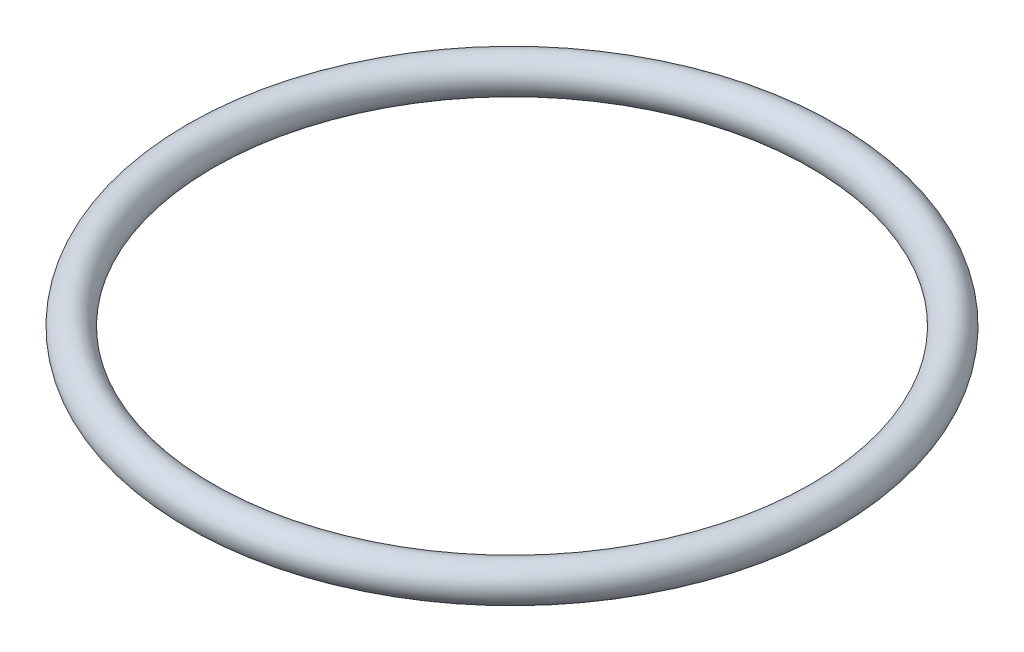
ISO-10303-21;
HEADER;
FILE_DESCRIPTION(('STEP AP214'),'2;1');
FILE_NAME('part.step','',(''),(''),'','','');
FILE_SCHEMA(('AUTOMOTIVE_DESIGN { 1 0 10303 214 1 1 1 1 }'));
ENDSEC;
DATA;
#1=APPLICATION_CONTEXT('core data for automotive mechanical design processes');
#2=APPLICATION_PROTOCOL_DEFINITION('international standard','automotive_design',2000,#1);
#3=PRODUCT_CONTEXT('',#1,'mechanical');
#4=PRODUCT('Part','Part','',(#3));
#5=PRODUCT_RELATED_PRODUCT_CATEGORY('part','',(#4));
#6=PRODUCT_DEFINITION_FORMATION('','',#4);
#7=PRODUCT_DEFINITION_CONTEXT('part definition',#1,'design');
#8=PRODUCT_DEFINITION('design','',#6,#7);
#9=PRODUCT_DEFINITION_SHAPE('','',#8);
#10=(LENGTH_UNIT() NAMED_UNIT(*) SI_UNIT(.MILLI.,.METRE.));
#11=(NAMED_UNIT(*) PLANE_ANGLE_UNIT() SI_UNIT($,.RADIAN.));
#12=(NAMED_UNIT(*) SI_UNIT($,.STERADIAN.) SOLID_ANGLE_UNIT());
#13=UNCERTAINTY_MEASURE_WITH_UNIT(LENGTH_MEASURE(1.E-05),#10,'distance_accuracy_value','');
#14=(GEOMETRIC_REPRESENTATION_CONTEXT(3) GLOBAL_UNCERTAINTY_ASSIGNED_CONTEXT((#13)) GLOBAL_UNIT_ASSIGNED_CONTEXT((#10,
#11,#12)) REPRESENTATION_CONTEXT('',''));
#15=CARTESIAN_POINT('',(0.,0.,0.));
#16=DIRECTION('',(0.,0.,1.));
#17=DIRECTION('',(1.,0.,0.));
#18=AXIS2_PLACEMENT_3D('',#15,#16,#17);
#19=CARTESIAN_POINT('',(46.5455,0.,0.));
#20=DIRECTION('',(0.,1.,0.));
#21=DIRECTION('',(0.,0.,1.));
#22=AXIS2_PLACEMENT_3D('',#19,#20,#21);
#23=TOROIDAL_SURFACE('',#22,46.5455,2.667);
#24=CARTESIAN_POINT('',(0.,0.,0.));
#25=DIRECTION('',(0.,0.,1.));
#26=DIRECTION('',(1.,0.,0.));
#27=AXIS2_PLACEMENT_3D('',#24,#25,#26);
#28=CIRCLE('',#27,2.667);
#29=CARTESIAN_POINT('',(-2.667,0.,0.));
#30=VERTEX_POINT('',#29);
#31=EDGE_CURVE('E10',#30,#30,#28,.T.);
#32=CARTESIAN_POINT('',(46.5455,0.,0.));
#33=DIRECTION('',(0.,1.,0.));
#34=DIRECTION('',(0.,0.,1.));
#35=AXIS2_PLACEMENT_3D('',#32,#33,#34);
#36=CIRCLE('',#35,49.2125);
#37=EDGE_CURVE('',#30,#30,#36,.T.);
#38=ORIENTED_EDGE('',*,*,#31,.T.);
#39=ORIENTED_EDGE('',*,*,#31,.F.);
#40=ORIENTED_EDGE('',*,*,#37,.T.);
#41=ORIENTED_EDGE('',*,*,#37,.F.);
#42=EDGE_LOOP('',(#38,#40,#39,#41));
#43=FACE_BOUND('',#42,.T.);
#44=ADVANCED_FACE('F36',(#43),#23,.T.);
#45=CLOSED_SHELL('',(#44));
#46=MANIFOLD_SOLID_BREP('B2',#45);
#47=ADVANCED_BREP_SHAPE_REPRESENTATION('',(#18,#46),#14);
#48=SHAPE_DEFINITION_REPRESENTATION(#9,#47);
ENDSEC;
END-ISO-10303-21;
